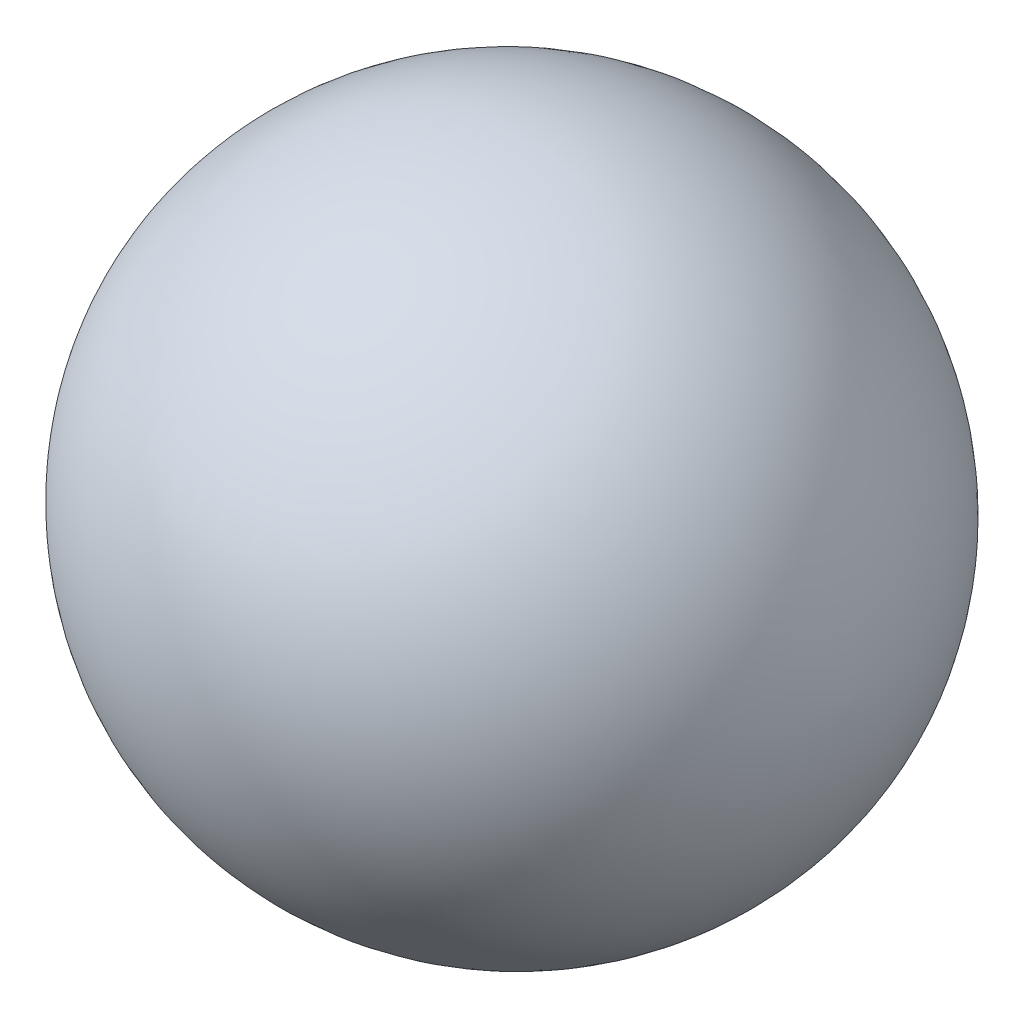
ISO-10303-21;
HEADER;
FILE_DESCRIPTION(('STEP AP214'),'2;1');
FILE_NAME('part.step','',(''),(''),'','','');
FILE_SCHEMA(('AUTOMOTIVE_DESIGN { 1 0 10303 214 1 1 1 1 }'));
ENDSEC;
DATA;
#1=APPLICATION_CONTEXT('core data for automotive mechanical design processes');
#2=APPLICATION_PROTOCOL_DEFINITION('international standard','automotive_design',2000,#1);
#3=PRODUCT_CONTEXT('',#1,'mechanical');
#4=PRODUCT('Part','Part','',(#3));
#5=PRODUCT_RELATED_PRODUCT_CATEGORY('part','',(#4));
#6=PRODUCT_DEFINITION_FORMATION('','',#4);
#7=PRODUCT_DEFINITION_CONTEXT('part definition',#1,'design');
#8=PRODUCT_DEFINITION('design','',#6,#7);
#9=PRODUCT_DEFINITION_SHAPE('','',#8);
#10=(LENGTH_UNIT() NAMED_UNIT(*) SI_UNIT(.MILLI.,.METRE.));
#11=(NAMED_UNIT(*) PLANE_ANGLE_UNIT() SI_UNIT($,.RADIAN.));
#12=(NAMED_UNIT(*) SI_UNIT($,.STERADIAN.) SOLID_ANGLE_UNIT());
#13=UNCERTAINTY_MEASURE_WITH_UNIT(LENGTH_MEASURE(1.E-05),#10,'distance_accuracy_value','');
#14=(GEOMETRIC_REPRESENTATION_CONTEXT(3) GLOBAL_UNCERTAINTY_ASSIGNED_CONTEXT((#13)) GLOBAL_UNIT_ASSIGNED_CONTEXT((#10,
#11,#12)) REPRESENTATION_CONTEXT('',''));
#15=CARTESIAN_POINT('',(0.,0.,0.));
#16=DIRECTION('',(0.,0.,1.));
#17=DIRECTION('',(1.,0.,0.));
#18=AXIS2_PLACEMENT_3D('',#15,#16,#17);
#19=CARTESIAN_POINT('',(0.,0.,-11.1218518856571));
#20=DIRECTION('',(0.,-1.,0.));
#21=DIRECTION('',(0.,0.,1.));
#22=AXIS2_PLACEMENT_3D('',#19,#20,#21);
#23=CIRCLE('',#22,305.002845215199);
#24=TRIMMED_CURVE('',#23,(PARAMETER_VALUE(-1.53432349290889)),
(PARAMETER_VALUE(1.53432349290889)),.T.,.PARAMETER.);
#25=CARTESIAN_POINT('',(0.,0.,0.));
#26=DIRECTION('',(-1.,0.,0.));
#27=AXIS1_PLACEMENT('',#25,#26);
#28=SURFACE_OF_REVOLUTION('',#24,#27);
#29=CARTESIAN_POINT('',(304.8,0.,-1.11981703314034E-13));
#30=VERTEX_POINT('',#29);
#31=VERTEX_LOOP('',#30);
#32=FACE_BOUND('',#31,.T.);
#33=CARTESIAN_POINT('',(-304.8,0.,0.));
#34=VERTEX_POINT('',#33);
#35=VERTEX_LOOP('',#34);
#36=FACE_BOUND('',#35,.T.);
#37=ADVANCED_FACE('F35',(#32,#36),#28,.T.);
#38=CLOSED_SHELL('',(#37));
#39=MANIFOLD_SOLID_BREP('B2',#38);
#40=ADVANCED_BREP_SHAPE_REPRESENTATION('',(#18,#39),#14);
#41=SHAPE_DEFINITION_REPRESENTATION(#9,#40);
ENDSEC;
END-ISO-10303-21;
